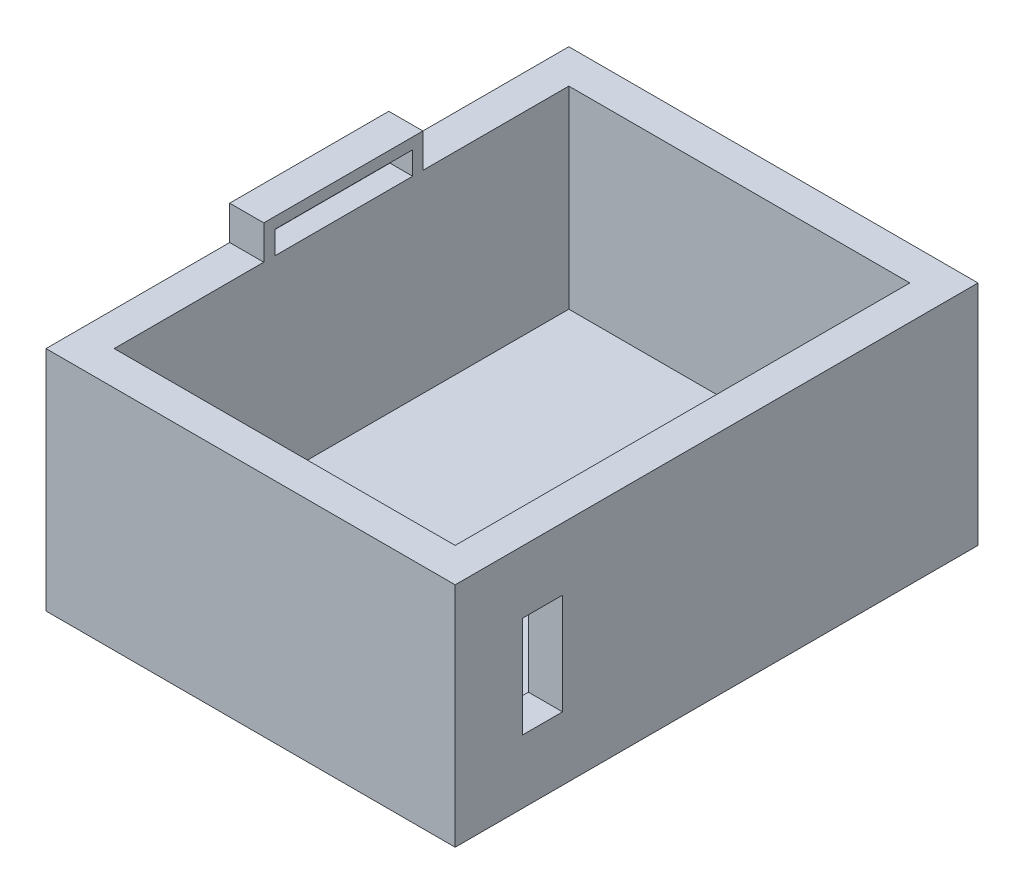
ISO-10303-21;
HEADER;
FILE_DESCRIPTION(('STEP AP214'),'2;1');
FILE_NAME('part.step','',(''),(''),'','','');
FILE_SCHEMA(('AUTOMOTIVE_DESIGN { 1 0 10303 214 1 1 1 1 }'));
ENDSEC;
DATA;
#1=APPLICATION_CONTEXT('core data for automotive mechanical design processes');
#2=APPLICATION_PROTOCOL_DEFINITION('international standard','automotive_design',2000,#1);
#3=PRODUCT_CONTEXT('',#1,'mechanical');
#4=PRODUCT('Part','Part','',(#3));
#5=PRODUCT_RELATED_PRODUCT_CATEGORY('part','',(#4));
#6=PRODUCT_DEFINITION_FORMATION('','',#4);
#7=PRODUCT_DEFINITION_CONTEXT('part definition',#1,'design');
#8=PRODUCT_DEFINITION('design','',#6,#7);
#9=PRODUCT_DEFINITION_SHAPE('','',#8);
#10=(LENGTH_UNIT() NAMED_UNIT(*) SI_UNIT(.MILLI.,.METRE.));
#11=(NAMED_UNIT(*) PLANE_ANGLE_UNIT() SI_UNIT($,.RADIAN.));
#12=(NAMED_UNIT(*) SI_UNIT($,.STERADIAN.) SOLID_ANGLE_UNIT());
#13=UNCERTAINTY_MEASURE_WITH_UNIT(LENGTH_MEASURE(1.E-05),#10,'distance_accuracy_value','');
#14=(GEOMETRIC_REPRESENTATION_CONTEXT(3) GLOBAL_UNCERTAINTY_ASSIGNED_CONTEXT((#13)) GLOBAL_UNIT_ASSIGNED_CONTEXT((#10,
#11,#12)) REPRESENTATION_CONTEXT('',''));
#15=CARTESIAN_POINT('',(0.,0.,0.));
#16=DIRECTION('',(0.,0.,1.));
#17=DIRECTION('',(1.,0.,0.));
#18=AXIS2_PLACEMENT_3D('',#15,#16,#17);
#19=CARTESIAN_POINT('',(75.,100.,-100.));
#20=DIRECTION('',(-1.,0.,0.));
#21=DIRECTION('',(0.,0.,1.));
#22=AXIS2_PLACEMENT_3D('',#19,#20,#21);
#23=PLANE('',#22);
#24=DIRECTION('',(0.,1.,0.));
#25=VECTOR('',#24,1.);
#26=CARTESIAN_POINT('',(75.,100.,85.4584047285034));
#27=LINE('',#26,#25);
#28=CARTESIAN_POINT('',(75.,27.9732756874127,85.4584047285034));
#29=VERTEX_POINT('',#28);
#30=CARTESIAN_POINT('',(75.,72.4584726693734,85.4584047285034));
#31=VERTEX_POINT('',#30);
#32=EDGE_CURVE('E205',#29,#31,#27,.T.);
#33=ORIENTED_EDGE('',*,*,#32,.F.);
#34=DIRECTION('',(0.,0.,1.));
#35=VECTOR('',#34,1.);
#36=CARTESIAN_POINT('',(75.,27.9732756874127,-100.));
#37=LINE('',#36,#35);
#38=CARTESIAN_POINT('',(75.,27.9732756874127,67.7683848760278));
#39=VERTEX_POINT('',#38);
#40=EDGE_CURVE('E198',#39,#29,#37,.T.);
#41=ORIENTED_EDGE('',*,*,#40,.F.);
#42=DIRECTION('',(0.,-1.,0.));
#43=VECTOR('',#42,1.);
#44=CARTESIAN_POINT('',(75.,100.,67.7683848760278));
#45=LINE('',#44,#43);
#46=CARTESIAN_POINT('',(75.,72.4584726693734,67.7683848760278));
#47=VERTEX_POINT('',#46);
#48=EDGE_CURVE('E179',#47,#39,#45,.T.);
#49=ORIENTED_EDGE('',*,*,#48,.F.);
#50=DIRECTION('',(0.,0.,-1.));
#51=VECTOR('',#50,1.);
#52=CARTESIAN_POINT('',(75.,72.4584726693734,-100.));
#53=LINE('',#52,#51);
#54=EDGE_CURVE('E203',#31,#47,#53,.T.);
#55=ORIENTED_EDGE('',*,*,#54,.F.);
#56=EDGE_LOOP('',(#33,#41,#49,#55));
#57=FACE_BOUND('',#56,.T.);
#58=DIRECTION('',(0.,-1.,0.));
#59=VECTOR('',#58,1.);
#60=CARTESIAN_POINT('',(75.,100.,-100.));
#61=LINE('',#60,#59);
#62=CARTESIAN_POINT('',(75.,100.,-100.));
#63=VERTEX_POINT('',#62);
#64=CARTESIAN_POINT('',(75.,15.,-100.));
#65=VERTEX_POINT('',#64);
#66=EDGE_CURVE('E294',#63,#65,#61,.T.);
#67=ORIENTED_EDGE('',*,*,#66,.T.);
#68=DIRECTION('',(0.,0.,1.));
#69=VECTOR('',#68,1.);
#70=CARTESIAN_POINT('',(75.,15.,-100.));
#71=LINE('',#70,#69);
#72=CARTESIAN_POINT('',(75.,15.,100.));
#73=VERTEX_POINT('',#72);
#74=EDGE_CURVE('E272',#65,#73,#71,.T.);
#75=ORIENTED_EDGE('',*,*,#74,.T.);
#76=DIRECTION('',(0.,-1.,0.));
#77=VECTOR('',#76,1.);
#78=CARTESIAN_POINT('',(75.,100.,100.));
#79=LINE('',#78,#77);
#80=CARTESIAN_POINT('',(75.,100.,100.));
#81=VERTEX_POINT('',#80);
#82=EDGE_CURVE('E285',#81,#73,#79,.T.);
#83=ORIENTED_EDGE('',*,*,#82,.F.);
#84=DIRECTION('',(0.,0.,-1.));
#85=VECTOR('',#84,1.);
#86=CARTESIAN_POINT('',(75.,100.,-100.));
#87=LINE('',#86,#85);
#88=EDGE_CURVE('E275',#81,#63,#87,.T.);
#89=ORIENTED_EDGE('',*,*,#88,.T.);
#90=EDGE_LOOP('',(#67,#75,#83,#89));
#91=FACE_BOUND('',#90,.T.);
#92=ADVANCED_FACE('F36',(#57,#91),#23,.T.);
#93=CARTESIAN_POINT('',(-75.,100.,-100.));
#94=DIRECTION('',(0.,0.,1.));
#95=DIRECTION('',(1.,0.,0.));
#96=AXIS2_PLACEMENT_3D('',#93,#94,#95);
#97=PLANE('',#96);
#98=DIRECTION('',(0.,-1.,0.));
#99=VECTOR('',#98,1.);
#100=CARTESIAN_POINT('',(-75.,100.,-100.));
#101=LINE('',#100,#99);
#102=CARTESIAN_POINT('',(-75.,100.,-100.));
#103=VERTEX_POINT('',#102);
#104=CARTESIAN_POINT('',(-75.,15.,-100.));
#105=VERTEX_POINT('',#104);
#106=EDGE_CURVE('E291',#103,#105,#101,.T.);
#107=ORIENTED_EDGE('',*,*,#106,.T.);
#108=DIRECTION('',(1.,0.,0.));
#109=VECTOR('',#108,1.);
#110=CARTESIAN_POINT('',(-75.,15.,-100.));
#111=LINE('',#110,#109);
#112=EDGE_CURVE('E269',#105,#65,#111,.T.);
#113=ORIENTED_EDGE('',*,*,#112,.T.);
#114=ORIENTED_EDGE('',*,*,#66,.F.);
#115=DIRECTION('',(-1.,0.,0.));
#116=VECTOR('',#115,1.);
#117=CARTESIAN_POINT('',(-75.,100.,-100.));
#118=LINE('',#117,#116);
#119=EDGE_CURVE('E277',#63,#103,#118,.T.);
#120=ORIENTED_EDGE('',*,*,#119,.T.);
#121=EDGE_LOOP('',(#107,#113,#114,#120));
#122=FACE_BOUND('',#121,.T.);
#123=ADVANCED_FACE('F361',(#122),#97,.T.);
#124=CARTESIAN_POINT('',(-75.,100.,-100.));
#125=DIRECTION('',(1.,0.,0.));
#126=DIRECTION('',(0.,0.,-1.));
#127=AXIS2_PLACEMENT_3D('',#124,#125,#126);
#128=PLANE('',#127);
#129=DIRECTION('',(0.,-1.,0.));
#130=VECTOR('',#129,1.);
#131=CARTESIAN_POINT('',(-75.,110.102082312034,29.2233790622416));
#132=LINE('',#131,#130);
#133=CARTESIAN_POINT('',(-75.,110.102082312034,29.2233790622416));
#134=VERTEX_POINT('',#133);
#135=CARTESIAN_POINT('',(-75.,100.,29.2233790622416));
#136=VERTEX_POINT('',#135);
#137=EDGE_CURVE('E207',#134,#136,#132,.T.);
#138=ORIENTED_EDGE('',*,*,#137,.F.);
#139=DIRECTION('',(0.,0.,1.));
#140=VECTOR('',#139,1.);
#141=CARTESIAN_POINT('',(-75.,110.102082312034,29.2233790622416));
#142=LINE('',#141,#140);
#143=CARTESIAN_POINT('',(-75.,110.102082312034,-31.3014860177789));
#144=VERTEX_POINT('',#143);
#145=EDGE_CURVE('E212',#144,#134,#142,.T.);
#146=ORIENTED_EDGE('',*,*,#145,.F.);
#147=DIRECTION('',(0.,1.,0.));
#148=VECTOR('',#147,1.);
#149=CARTESIAN_POINT('',(-75.,110.102082312034,-31.3014860177789));
#150=LINE('',#149,#148);
#151=CARTESIAN_POINT('',(-75.,100.,-31.3014860177789));
#152=VERTEX_POINT('',#151);
#153=EDGE_CURVE('E226',#152,#144,#150,.T.);
#154=ORIENTED_EDGE('',*,*,#153,.F.);
#155=DIRECTION('',(0.,0.,-1.));
#156=VECTOR('',#155,1.);
#157=CARTESIAN_POINT('',(-75.,100.,29.2233790622416));
#158=LINE('',#157,#156);
#159=EDGE_CURVE('E223',#136,#152,#158,.T.);
#160=ORIENTED_EDGE('',*,*,#159,.F.);
#161=EDGE_LOOP('',(#138,#146,#154,#160));
#162=FACE_BOUND('',#161,.T.);
#163=DIRECTION('',(0.,-1.,0.));
#164=VECTOR('',#163,1.);
#165=CARTESIAN_POINT('',(-75.,100.,100.));
#166=LINE('',#165,#164);
#167=CARTESIAN_POINT('',(-75.,100.,100.));
#168=VERTEX_POINT('',#167);
#169=CARTESIAN_POINT('',(-75.,15.,100.));
#170=VERTEX_POINT('',#169);
#171=EDGE_CURVE('E288',#168,#170,#166,.T.);
#172=ORIENTED_EDGE('',*,*,#171,.T.);
#173=DIRECTION('',(0.,0.,-1.));
#174=VECTOR('',#173,1.);
#175=CARTESIAN_POINT('',(-75.,15.,-100.));
#176=LINE('',#175,#174);
#177=EDGE_CURVE('E266',#170,#105,#176,.T.);
#178=ORIENTED_EDGE('',*,*,#177,.T.);
#179=ORIENTED_EDGE('',*,*,#106,.F.);
#180=DIRECTION('',(0.,0.,1.));
#181=VECTOR('',#180,1.);
#182=CARTESIAN_POINT('',(-75.,100.,-100.));
#183=LINE('',#182,#181);
#184=CARTESIAN_POINT('',(-75.,100.,-35.8015043884086));
#185=VERTEX_POINT('',#184);
#186=EDGE_CURVE('E280',#103,#185,#183,.T.);
#187=ORIENTED_EDGE('',*,*,#186,.T.);
#188=DIRECTION('',(0.,-1.,0.));
#189=VECTOR('',#188,1.);
#190=CARTESIAN_POINT('',(-75.,115.,-35.8015043884086));
#191=LINE('',#190,#189);
#192=CARTESIAN_POINT('',(-75.,115.,-35.8015043884086));
#193=VERTEX_POINT('',#192);
#194=EDGE_CURVE('E263',#193,#185,#191,.T.);
#195=ORIENTED_EDGE('',*,*,#194,.F.);
#196=DIRECTION('',(0.,0.,-1.));
#197=VECTOR('',#196,1.);
#198=CARTESIAN_POINT('',(-75.,115.,-35.8015043884086));
#199=LINE('',#198,#197);
#200=CARTESIAN_POINT('',(-75.,115.,34.1984956115914));
#201=VERTEX_POINT('',#200);
#202=EDGE_CURVE('E240',#201,#193,#199,.T.);
#203=ORIENTED_EDGE('',*,*,#202,.F.);
#204=DIRECTION('',(0.,-1.,0.));
#205=VECTOR('',#204,1.);
#206=CARTESIAN_POINT('',(-75.,115.,34.1984956115914));
#207=LINE('',#206,#205);
#208=CARTESIAN_POINT('',(-75.,100.,34.1984956115914));
#209=VERTEX_POINT('',#208);
#210=EDGE_CURVE('E250',#201,#209,#207,.T.);
#211=ORIENTED_EDGE('',*,*,#210,.T.);
#212=EDGE_CURVE('E279',#209,#168,#183,.T.);
#213=ORIENTED_EDGE('',*,*,#212,.T.);
#214=EDGE_LOOP('',(#172,#178,#179,#187,#195,#203,#211,#213));
#215=FACE_BOUND('',#214,.T.);
#216=ADVANCED_FACE('F354',(#162,#215),#128,.T.);
#217=CARTESIAN_POINT('',(-75.,100.,100.));
#218=DIRECTION('',(0.,0.,-1.));
#219=DIRECTION('',(-1.,0.,0.));
#220=AXIS2_PLACEMENT_3D('',#217,#218,#219);
#221=PLANE('',#220);
#222=ORIENTED_EDGE('',*,*,#82,.T.);
#223=DIRECTION('',(-1.,0.,0.));
#224=VECTOR('',#223,1.);
#225=CARTESIAN_POINT('',(-75.,15.,100.));
#226=LINE('',#225,#224);
#227=EDGE_CURVE('E11',#73,#170,#226,.T.);
#228=ORIENTED_EDGE('',*,*,#227,.T.);
#229=ORIENTED_EDGE('',*,*,#171,.F.);
#230=DIRECTION('',(1.,0.,0.));
#231=VECTOR('',#230,1.);
#232=CARTESIAN_POINT('',(-75.,100.,100.));
#233=LINE('',#232,#231);
#234=EDGE_CURVE('E283',#168,#81,#233,.T.);
#235=ORIENTED_EDGE('',*,*,#234,.T.);
#236=EDGE_LOOP('',(#222,#228,#229,#235));
#237=FACE_BOUND('',#236,.T.);
#238=ADVANCED_FACE('F365',(#237),#221,.T.);
#239=CARTESIAN_POINT('',(0.,100.,0.));
#240=DIRECTION('',(0.,1.,0.));
#241=DIRECTION('',(0.,0.,1.));
#242=AXIS2_PLACEMENT_3D('',#239,#240,#241);
#243=PLANE('',#242);
#244=DIRECTION('',(1.,0.,0.));
#245=VECTOR('',#244,1.);
#246=CARTESIAN_POINT('',(-90.,100.,34.1984956115914));
#247=LINE('',#246,#245);
#248=CARTESIAN_POINT('',(-90.,100.,34.1984956115914));
#249=VERTEX_POINT('',#248);
#250=EDGE_CURVE('E244',#249,#209,#247,.T.);
#251=ORIENTED_EDGE('',*,*,#250,.F.);
#252=DIRECTION('',(0.,0.,1.));
#253=VECTOR('',#252,1.);
#254=CARTESIAN_POINT('',(-90.,100.,-115.));
#255=LINE('',#254,#253);
#256=CARTESIAN_POINT('',(-89.9999999999999,100.,115.));
#257=VERTEX_POINT('',#256);
#258=EDGE_CURVE('E304',#249,#257,#255,.T.);
#259=ORIENTED_EDGE('',*,*,#258,.T.);
#260=DIRECTION('',(1.,0.,0.));
#261=VECTOR('',#260,1.);
#262=CARTESIAN_POINT('',(-89.9999999999999,100.,115.));
#263=LINE('',#262,#261);
#264=CARTESIAN_POINT('',(90.,100.,115.));
#265=VERTEX_POINT('',#264);
#266=EDGE_CURVE('E307',#257,#265,#263,.T.);
#267=ORIENTED_EDGE('',*,*,#266,.T.);
#268=DIRECTION('',(0.,0.,-1.));
#269=VECTOR('',#268,1.);
#270=CARTESIAN_POINT('',(89.9999999999999,100.,-115.));
#271=LINE('',#270,#269);
#272=CARTESIAN_POINT('',(89.9999999999999,100.,-115.));
#273=VERTEX_POINT('',#272);
#274=EDGE_CURVE('E298',#265,#273,#271,.T.);
#275=ORIENTED_EDGE('',*,*,#274,.T.);
#276=DIRECTION('',(-1.,0.,0.));
#277=VECTOR('',#276,1.);
#278=CARTESIAN_POINT('',(-90.,100.,-115.));
#279=LINE('',#278,#277);
#280=CARTESIAN_POINT('',(-90.,100.,-115.));
#281=VERTEX_POINT('',#280);
#282=EDGE_CURVE('E301',#273,#281,#279,.T.);
#283=ORIENTED_EDGE('',*,*,#282,.T.);
#284=CARTESIAN_POINT('',(-90.,100.,-35.8015043884086));
#285=VERTEX_POINT('',#284);
#286=EDGE_CURVE('E305',#281,#285,#255,.T.);
#287=ORIENTED_EDGE('',*,*,#286,.T.);
#288=DIRECTION('',(-1.,0.,0.));
#289=VECTOR('',#288,1.);
#290=CARTESIAN_POINT('',(-90.,100.,-35.8015043884086));
#291=LINE('',#290,#289);
#292=EDGE_CURVE('E233',#185,#285,#291,.T.);
#293=ORIENTED_EDGE('',*,*,#292,.F.);
#294=ORIENTED_EDGE('',*,*,#186,.F.);
#295=ORIENTED_EDGE('',*,*,#119,.F.);
#296=ORIENTED_EDGE('',*,*,#88,.F.);
#297=ORIENTED_EDGE('',*,*,#234,.F.);
#298=ORIENTED_EDGE('',*,*,#212,.F.);
#299=EDGE_LOOP('',(#251,#259,#267,#275,#283,#287,#293,#294,#295,#296,#297,#298));
#300=FACE_BOUND('',#299,.T.);
#301=ADVANCED_FACE('F347',(#300),#243,.T.);
#302=CARTESIAN_POINT('',(0.,0.,0.));
#303=DIRECTION('',(0.,1.,0.));
#304=DIRECTION('',(0.,0.,1.));
#305=AXIS2_PLACEMENT_3D('',#302,#303,#304);
#306=PLANE('',#305);
#307=DIRECTION('',(0.,0.,-1.));
#308=VECTOR('',#307,1.);
#309=CARTESIAN_POINT('',(89.9999999999999,0.,-115.));
#310=LINE('',#309,#308);
#311=CARTESIAN_POINT('',(90.,0.,115.));
#312=VERTEX_POINT('',#311);
#313=CARTESIAN_POINT('',(89.9999999999999,0.,-115.));
#314=VERTEX_POINT('',#313);
#315=EDGE_CURVE('E297',#312,#314,#310,.T.);
#316=ORIENTED_EDGE('',*,*,#315,.F.);
#317=DIRECTION('',(1.,0.,0.));
#318=VECTOR('',#317,1.);
#319=CARTESIAN_POINT('',(-89.9999999999999,0.,115.));
#320=LINE('',#319,#318);
#321=CARTESIAN_POINT('',(-89.9999999999999,0.,115.));
#322=VERTEX_POINT('',#321);
#323=EDGE_CURVE('E302',#322,#312,#320,.T.);
#324=ORIENTED_EDGE('',*,*,#323,.F.);
#325=DIRECTION('',(0.,0.,1.));
#326=VECTOR('',#325,1.);
#327=CARTESIAN_POINT('',(-90.,0.,-115.));
#328=LINE('',#327,#326);
#329=CARTESIAN_POINT('',(-90.,0.,-115.));
#330=VERTEX_POINT('',#329);
#331=EDGE_CURVE('E315',#330,#322,#328,.T.);
#332=ORIENTED_EDGE('',*,*,#331,.F.);
#333=DIRECTION('',(-1.,0.,0.));
#334=VECTOR('',#333,1.);
#335=CARTESIAN_POINT('',(-90.,0.,-115.));
#336=LINE('',#335,#334);
#337=EDGE_CURVE('E312',#314,#330,#336,.T.);
#338=ORIENTED_EDGE('',*,*,#337,.F.);
#339=EDGE_LOOP('',(#316,#324,#332,#338));
#340=FACE_BOUND('',#339,.T.);
#341=ADVANCED_FACE('F333',(#340),#306,.F.);
#342=CARTESIAN_POINT('',(89.9999999999999,100.,-115.));
#343=DIRECTION('',(-1.,0.,0.));
#344=DIRECTION('',(0.,0.,1.));
#345=AXIS2_PLACEMENT_3D('',#342,#343,#344);
#346=PLANE('',#345);
#347=DIRECTION('',(0.,0.,-1.));
#348=VECTOR('',#347,1.);
#349=CARTESIAN_POINT('',(90.,27.9732756874127,85.4584047285034));
#350=LINE('',#349,#348);
#351=CARTESIAN_POINT('',(90.,27.9732756874127,85.4584047285034));
#352=VERTEX_POINT('',#351);
#353=CARTESIAN_POINT('',(90.,27.9732756874127,67.7683848760278));
#354=VERTEX_POINT('',#353);
#355=EDGE_CURVE('E185',#352,#354,#350,.T.);
#356=ORIENTED_EDGE('',*,*,#355,.F.);
#357=DIRECTION('',(0.,-1.,0.));
#358=VECTOR('',#357,1.);
#359=CARTESIAN_POINT('',(90.,72.4584726693734,85.4584047285034));
#360=LINE('',#359,#358);
#361=CARTESIAN_POINT('',(90.,72.4584726693734,85.4584047285034));
#362=VERTEX_POINT('',#361);
#363=EDGE_CURVE('E59',#362,#352,#360,.T.);
#364=ORIENTED_EDGE('',*,*,#363,.F.);
#365=DIRECTION('',(0.,0.,1.));
#366=VECTOR('',#365,1.);
#367=CARTESIAN_POINT('',(90.,72.4584726693734,85.4584047285034));
#368=LINE('',#367,#366);
#369=CARTESIAN_POINT('',(90.,72.4584726693734,67.7683848760278));
#370=VERTEX_POINT('',#369);
#371=EDGE_CURVE('E191',#370,#362,#368,.T.);
#372=ORIENTED_EDGE('',*,*,#371,.F.);
#373=DIRECTION('',(0.,1.,0.));
#374=VECTOR('',#373,1.);
#375=CARTESIAN_POINT('',(90.,72.4584726693734,67.7683848760278));
#376=LINE('',#375,#374);
#377=EDGE_CURVE('E176',#354,#370,#376,.T.);
#378=ORIENTED_EDGE('',*,*,#377,.F.);
#379=EDGE_LOOP('',(#356,#364,#372,#378));
#380=FACE_BOUND('',#379,.T.);
#381=ORIENTED_EDGE('',*,*,#315,.T.);
#382=DIRECTION('',(0.,-1.,0.));
#383=VECTOR('',#382,1.);
#384=CARTESIAN_POINT('',(89.9999999999999,100.,-115.));
#385=LINE('',#384,#383);
#386=EDGE_CURVE('E44',#273,#314,#385,.T.);
#387=ORIENTED_EDGE('',*,*,#386,.F.);
#388=ORIENTED_EDGE('',*,*,#274,.F.);
#389=DIRECTION('',(0.,-1.,0.));
#390=VECTOR('',#389,1.);
#391=CARTESIAN_POINT('',(90.,100.,115.));
#392=LINE('',#391,#390);
#393=EDGE_CURVE('E309',#265,#312,#392,.T.);
#394=ORIENTED_EDGE('',*,*,#393,.T.);
#395=EDGE_LOOP('',(#381,#387,#388,#394));
#396=FACE_BOUND('',#395,.T.);
#397=ADVANCED_FACE('F38',(#380,#396),#346,.F.);
#398=CARTESIAN_POINT('',(-90.,100.,-115.));
#399=DIRECTION('',(0.,0.,1.));
#400=DIRECTION('',(1.,0.,0.));
#401=AXIS2_PLACEMENT_3D('',#398,#399,#400);
#402=PLANE('',#401);
#403=ORIENTED_EDGE('',*,*,#337,.T.);
#404=DIRECTION('',(0.,-1.,0.));
#405=VECTOR('',#404,1.);
#406=CARTESIAN_POINT('',(-90.,100.,-115.));
#407=LINE('',#406,#405);
#408=EDGE_CURVE('E323',#281,#330,#407,.T.);
#409=ORIENTED_EDGE('',*,*,#408,.F.);
#410=ORIENTED_EDGE('',*,*,#282,.F.);
#411=ORIENTED_EDGE('',*,*,#386,.T.);
#412=EDGE_LOOP('',(#403,#409,#410,#411));
#413=FACE_BOUND('',#412,.T.);
#414=ADVANCED_FACE('F327',(#413),#402,.F.);
#415=CARTESIAN_POINT('',(-90.,100.,-115.));
#416=DIRECTION('',(1.,0.,0.));
#417=DIRECTION('',(0.,0.,-1.));
#418=AXIS2_PLACEMENT_3D('',#415,#416,#417);
#419=PLANE('',#418);
#420=ORIENTED_EDGE('',*,*,#331,.T.);
#421=DIRECTION('',(0.,-1.,0.));
#422=VECTOR('',#421,1.);
#423=CARTESIAN_POINT('',(-89.9999999999999,100.,115.));
#424=LINE('',#423,#422);
#425=EDGE_CURVE('E321',#257,#322,#424,.T.);
#426=ORIENTED_EDGE('',*,*,#425,.F.);
#427=ORIENTED_EDGE('',*,*,#258,.F.);
#428=DIRECTION('',(0.,-1.,0.));
#429=VECTOR('',#428,1.);
#430=CARTESIAN_POINT('',(-90.,115.,34.1984956115914));
#431=LINE('',#430,#429);
#432=CARTESIAN_POINT('',(-90.,115.,34.1984956115914));
#433=VERTEX_POINT('',#432);
#434=EDGE_CURVE('E257',#433,#249,#431,.T.);
#435=ORIENTED_EDGE('',*,*,#434,.F.);
#436=DIRECTION('',(0.,0.,1.));
#437=VECTOR('',#436,1.);
#438=CARTESIAN_POINT('',(-90.,115.,-35.8015043884086));
#439=LINE('',#438,#437);
#440=CARTESIAN_POINT('',(-90.,115.,-35.8015043884086));
#441=VERTEX_POINT('',#440);
#442=EDGE_CURVE('E246',#441,#433,#439,.T.);
#443=ORIENTED_EDGE('',*,*,#442,.F.);
#444=DIRECTION('',(0.,-1.,0.));
#445=VECTOR('',#444,1.);
#446=CARTESIAN_POINT('',(-90.,115.,-35.8015043884086));
#447=LINE('',#446,#445);
#448=EDGE_CURVE('E260',#441,#285,#447,.T.);
#449=ORIENTED_EDGE('',*,*,#448,.T.);
#450=ORIENTED_EDGE('',*,*,#286,.F.);
#451=ORIENTED_EDGE('',*,*,#408,.T.);
#452=EDGE_LOOP('',(#420,#426,#427,#435,#443,#449,#450,#451));
#453=FACE_BOUND('',#452,.T.);
#454=ADVANCED_FACE('F342',(#453),#419,.F.);
#455=CARTESIAN_POINT('',(-89.9999999999999,100.,115.));
#456=DIRECTION('',(0.,0.,-1.));
#457=DIRECTION('',(-1.,0.,0.));
#458=AXIS2_PLACEMENT_3D('',#455,#456,#457);
#459=PLANE('',#458);
#460=ORIENTED_EDGE('',*,*,#323,.T.);
#461=ORIENTED_EDGE('',*,*,#393,.F.);
#462=ORIENTED_EDGE('',*,*,#266,.F.);
#463=ORIENTED_EDGE('',*,*,#425,.T.);
#464=EDGE_LOOP('',(#460,#461,#462,#463));
#465=FACE_BOUND('',#464,.T.);
#466=ADVANCED_FACE('F338',(#465),#459,.F.);
#467=CARTESIAN_POINT('',(0.,15.,0.));
#468=DIRECTION('',(0.,-1.,0.));
#469=DIRECTION('',(0.,0.,-1.));
#470=AXIS2_PLACEMENT_3D('',#467,#468,#469);
#471=PLANE('',#470);
#472=ORIENTED_EDGE('',*,*,#74,.F.);
#473=ORIENTED_EDGE('',*,*,#112,.F.);
#474=ORIENTED_EDGE('',*,*,#177,.F.);
#475=ORIENTED_EDGE('',*,*,#227,.F.);
#476=EDGE_LOOP('',(#472,#473,#474,#475));
#477=FACE_BOUND('',#476,.T.);
#478=ADVANCED_FACE('F402',(#477),#471,.F.);
#479=CARTESIAN_POINT('',(-90.,115.,-35.8015043884086));
#480=DIRECTION('',(0.,0.,1.));
#481=DIRECTION('',(1.,0.,0.));
#482=AXIS2_PLACEMENT_3D('',#479,#480,#481);
#483=PLANE('',#482);
#484=ORIENTED_EDGE('',*,*,#292,.T.);
#485=ORIENTED_EDGE('',*,*,#448,.F.);
#486=DIRECTION('',(-1.,0.,0.));
#487=VECTOR('',#486,1.);
#488=CARTESIAN_POINT('',(-90.,115.,-35.8015043884086));
#489=LINE('',#488,#487);
#490=EDGE_CURVE('E243',#193,#441,#489,.T.);
#491=ORIENTED_EDGE('',*,*,#490,.F.);
#492=ORIENTED_EDGE('',*,*,#194,.T.);
#493=EDGE_LOOP('',(#484,#485,#491,#492));
#494=FACE_BOUND('',#493,.T.);
#495=ADVANCED_FACE('F350',(#494),#483,.F.);
#496=CARTESIAN_POINT('',(-90.,115.,34.1984956115914));
#497=DIRECTION('',(0.,0.,-1.));
#498=DIRECTION('',(-1.,0.,0.));
#499=AXIS2_PLACEMENT_3D('',#496,#497,#498);
#500=PLANE('',#499);
#501=ORIENTED_EDGE('',*,*,#250,.T.);
#502=ORIENTED_EDGE('',*,*,#210,.F.);
#503=DIRECTION('',(1.,0.,0.));
#504=VECTOR('',#503,1.);
#505=CARTESIAN_POINT('',(-90.,115.,34.1984956115914));
#506=LINE('',#505,#504);
#507=EDGE_CURVE('E248',#433,#201,#506,.T.);
#508=ORIENTED_EDGE('',*,*,#507,.F.);
#509=ORIENTED_EDGE('',*,*,#434,.T.);
#510=EDGE_LOOP('',(#501,#502,#508,#509));
#511=FACE_BOUND('',#510,.T.);
#512=ADVANCED_FACE('F369',(#511),#500,.F.);
#513=CARTESIAN_POINT('',(0.,115.,0.));
#514=DIRECTION('',(0.,1.,0.));
#515=DIRECTION('',(0.,0.,1.));
#516=AXIS2_PLACEMENT_3D('',#513,#514,#515);
#517=PLANE('',#516);
#518=ORIENTED_EDGE('',*,*,#202,.T.);
#519=ORIENTED_EDGE('',*,*,#490,.T.);
#520=ORIENTED_EDGE('',*,*,#442,.T.);
#521=ORIENTED_EDGE('',*,*,#507,.T.);
#522=EDGE_LOOP('',(#518,#519,#520,#521));
#523=FACE_BOUND('',#522,.T.);
#524=ADVANCED_FACE('F373',(#523),#517,.T.);
#525=CARTESIAN_POINT('',(-85.,110.102082312034,29.2233790622416));
#526=DIRECTION('',(0.,0.,1.));
#527=DIRECTION('',(1.,0.,0.));
#528=AXIS2_PLACEMENT_3D('',#525,#526,#527);
#529=PLANE('',#528);
#530=ORIENTED_EDGE('',*,*,#137,.T.);
#531=DIRECTION('',(1.,0.,0.));
#532=VECTOR('',#531,1.);
#533=CARTESIAN_POINT('',(-85.,100.,29.2233790622416));
#534=LINE('',#533,#532);
#535=CARTESIAN_POINT('',(-85.,100.,29.2233790622416));
#536=VERTEX_POINT('',#535);
#537=EDGE_CURVE('E221',#536,#136,#534,.T.);
#538=ORIENTED_EDGE('',*,*,#537,.F.);
#539=DIRECTION('',(0.,-1.,0.));
#540=VECTOR('',#539,1.);
#541=CARTESIAN_POINT('',(-85.,110.102082312034,29.2233790622416));
#542=LINE('',#541,#540);
#543=CARTESIAN_POINT('',(-85.,110.102082312034,29.2233790622416));
#544=VERTEX_POINT('',#543);
#545=EDGE_CURVE('E208',#544,#536,#542,.T.);
#546=ORIENTED_EDGE('',*,*,#545,.F.);
#547=DIRECTION('',(1.,0.,0.));
#548=VECTOR('',#547,1.);
#549=CARTESIAN_POINT('',(-85.,110.102082312034,29.2233790622416));
#550=LINE('',#549,#548);
#551=EDGE_CURVE('E231',#544,#134,#550,.T.);
#552=ORIENTED_EDGE('',*,*,#551,.T.);
#553=EDGE_LOOP('',(#530,#538,#546,#552));
#554=FACE_BOUND('',#553,.T.);
#555=ADVANCED_FACE('F375',(#554),#529,.F.);
#556=CARTESIAN_POINT('',(-85.,110.102082312034,29.2233790622416));
#557=DIRECTION('',(0.,1.,0.));
#558=DIRECTION('',(0.,0.,1.));
#559=AXIS2_PLACEMENT_3D('',#556,#557,#558);
#560=PLANE('',#559);
#561=ORIENTED_EDGE('',*,*,#145,.T.);
#562=ORIENTED_EDGE('',*,*,#551,.F.);
#563=DIRECTION('',(0.,0.,1.));
#564=VECTOR('',#563,1.);
#565=CARTESIAN_POINT('',(-85.,110.102082312034,29.2233790622416));
#566=LINE('',#565,#564);
#567=CARTESIAN_POINT('',(-85.,110.102082312034,-31.3014860177789));
#568=VERTEX_POINT('',#567);
#569=EDGE_CURVE('E218',#568,#544,#566,.T.);
#570=ORIENTED_EDGE('',*,*,#569,.F.);
#571=DIRECTION('',(1.,0.,0.));
#572=VECTOR('',#571,1.);
#573=CARTESIAN_POINT('',(-85.,110.102082312034,-31.3014860177789));
#574=LINE('',#573,#572);
#575=EDGE_CURVE('E234',#568,#144,#574,.T.);
#576=ORIENTED_EDGE('',*,*,#575,.T.);
#577=EDGE_LOOP('',(#561,#562,#570,#576));
#578=FACE_BOUND('',#577,.T.);
#579=ADVANCED_FACE('F381',(#578),#560,.F.);
#580=CARTESIAN_POINT('',(-85.,110.102082312034,-31.3014860177789));
#581=DIRECTION('',(0.,0.,-1.));
#582=DIRECTION('',(-1.,0.,0.));
#583=AXIS2_PLACEMENT_3D('',#580,#581,#582);
#584=PLANE('',#583);
#585=ORIENTED_EDGE('',*,*,#153,.T.);
#586=ORIENTED_EDGE('',*,*,#575,.F.);
#587=DIRECTION('',(0.,1.,0.));
#588=VECTOR('',#587,1.);
#589=CARTESIAN_POINT('',(-85.,110.102082312034,-31.3014860177789));
#590=LINE('',#589,#588);
#591=CARTESIAN_POINT('',(-85.,100.,-31.3014860177789));
#592=VERTEX_POINT('',#591);
#593=EDGE_CURVE('E215',#592,#568,#590,.T.);
#594=ORIENTED_EDGE('',*,*,#593,.F.);
#595=DIRECTION('',(1.,0.,0.));
#596=VECTOR('',#595,1.);
#597=CARTESIAN_POINT('',(-85.,100.,-31.3014860177789));
#598=LINE('',#597,#596);
#599=EDGE_CURVE('E236',#592,#152,#598,.T.);
#600=ORIENTED_EDGE('',*,*,#599,.T.);
#601=EDGE_LOOP('',(#585,#586,#594,#600));
#602=FACE_BOUND('',#601,.T.);
#603=ADVANCED_FACE('F471',(#602),#584,.F.);
#604=CARTESIAN_POINT('',(-85.,100.,29.2233790622416));
#605=DIRECTION('',(0.,-1.,0.));
#606=DIRECTION('',(0.,0.,-1.));
#607=AXIS2_PLACEMENT_3D('',#604,#605,#606);
#608=PLANE('',#607);
#609=ORIENTED_EDGE('',*,*,#159,.T.);
#610=ORIENTED_EDGE('',*,*,#599,.F.);
#611=DIRECTION('',(0.,0.,-1.));
#612=VECTOR('',#611,1.);
#613=CARTESIAN_POINT('',(-85.,100.,29.2233790622416));
#614=LINE('',#613,#612);
#615=EDGE_CURVE('E211',#536,#592,#614,.T.);
#616=ORIENTED_EDGE('',*,*,#615,.F.);
#617=ORIENTED_EDGE('',*,*,#537,.T.);
#618=EDGE_LOOP('',(#609,#610,#616,#617));
#619=FACE_BOUND('',#618,.T.);
#620=ADVANCED_FACE('F459',(#619),#608,.F.);
#621=CARTESIAN_POINT('',(-85.,0.,0.));
#622=DIRECTION('',(1.,0.,0.));
#623=DIRECTION('',(0.,0.,-1.));
#624=AXIS2_PLACEMENT_3D('',#621,#622,#623);
#625=PLANE('',#624);
#626=ORIENTED_EDGE('',*,*,#545,.T.);
#627=ORIENTED_EDGE('',*,*,#615,.T.);
#628=ORIENTED_EDGE('',*,*,#593,.T.);
#629=ORIENTED_EDGE('',*,*,#569,.T.);
#630=EDGE_LOOP('',(#626,#627,#628,#629));
#631=FACE_BOUND('',#630,.T.);
#632=ADVANCED_FACE('F453',(#631),#625,.T.);
#633=CARTESIAN_POINT('',(70.,72.4584726693734,85.4584047285034));
#634=DIRECTION('',(0.,0.,1.));
#635=DIRECTION('',(1.,0.,0.));
#636=AXIS2_PLACEMENT_3D('',#633,#634,#635);
#637=PLANE('',#636);
#638=ORIENTED_EDGE('',*,*,#32,.T.);
#639=DIRECTION('',(1.,0.,0.));
#640=VECTOR('',#639,1.);
#641=CARTESIAN_POINT('',(70.,72.4584726693734,85.4584047285034));
#642=LINE('',#641,#640);
#643=EDGE_CURVE('E196',#31,#362,#642,.T.);
#644=ORIENTED_EDGE('',*,*,#643,.T.);
#645=ORIENTED_EDGE('',*,*,#363,.T.);
#646=DIRECTION('',(1.,0.,0.));
#647=VECTOR('',#646,1.);
#648=CARTESIAN_POINT('',(70.,27.9732756874127,85.4584047285034));
#649=LINE('',#648,#647);
#650=EDGE_CURVE('E182',#29,#352,#649,.T.);
#651=ORIENTED_EDGE('',*,*,#650,.F.);
#652=EDGE_LOOP('',(#638,#644,#645,#651));
#653=FACE_BOUND('',#652,.T.);
#654=ADVANCED_FACE('F458',(#653),#637,.F.);
#655=CARTESIAN_POINT('',(70.,72.4584726693734,85.4584047285034));
#656=DIRECTION('',(0.,1.,0.));
#657=DIRECTION('',(0.,0.,1.));
#658=AXIS2_PLACEMENT_3D('',#655,#656,#657);
#659=PLANE('',#658);
#660=ORIENTED_EDGE('',*,*,#54,.T.);
#661=DIRECTION('',(1.,0.,0.));
#662=VECTOR('',#661,1.);
#663=CARTESIAN_POINT('',(70.,72.4584726693734,67.7683848760278));
#664=LINE('',#663,#662);
#665=EDGE_CURVE('E181',#47,#370,#664,.T.);
#666=ORIENTED_EDGE('',*,*,#665,.T.);
#667=ORIENTED_EDGE('',*,*,#371,.T.);
#668=ORIENTED_EDGE('',*,*,#643,.F.);
#669=EDGE_LOOP('',(#660,#666,#667,#668));
#670=FACE_BOUND('',#669,.T.);
#671=ADVANCED_FACE('F564',(#670),#659,.F.);
#672=CARTESIAN_POINT('',(70.,72.4584726693734,67.7683848760278));
#673=DIRECTION('',(0.,0.,-1.));
#674=DIRECTION('',(-1.,0.,0.));
#675=AXIS2_PLACEMENT_3D('',#672,#673,#674);
#676=PLANE('',#675);
#677=ORIENTED_EDGE('',*,*,#48,.T.);
#678=DIRECTION('',(1.,0.,0.));
#679=VECTOR('',#678,1.);
#680=CARTESIAN_POINT('',(70.,27.9732756874127,67.7683848760278));
#681=LINE('',#680,#679);
#682=EDGE_CURVE('E51',#39,#354,#681,.T.);
#683=ORIENTED_EDGE('',*,*,#682,.T.);
#684=ORIENTED_EDGE('',*,*,#377,.T.);
#685=ORIENTED_EDGE('',*,*,#665,.F.);
#686=EDGE_LOOP('',(#677,#683,#684,#685));
#687=FACE_BOUND('',#686,.T.);
#688=ADVANCED_FACE('F173',(#687),#676,.F.);
#689=CARTESIAN_POINT('',(70.,27.9732756874127,85.4584047285034));
#690=DIRECTION('',(0.,-1.,0.));
#691=DIRECTION('',(0.,0.,-1.));
#692=AXIS2_PLACEMENT_3D('',#689,#690,#691);
#693=PLANE('',#692);
#694=ORIENTED_EDGE('',*,*,#40,.T.);
#695=ORIENTED_EDGE('',*,*,#650,.T.);
#696=ORIENTED_EDGE('',*,*,#355,.T.);
#697=ORIENTED_EDGE('',*,*,#682,.F.);
#698=EDGE_LOOP('',(#694,#695,#696,#697));
#699=FACE_BOUND('',#698,.T.);
#700=ADVANCED_FACE('F186',(#699),#693,.F.);
#701=CLOSED_SHELL('',(#92,#123,#216,#238,#301,#341,#397,#414,#454,#466,#478,#495,#512,#524,#555,
#579,#603,#620,#632,#654,#671,#688,#700));
#702=MANIFOLD_SOLID_BREP('B2',#701);
#703=ADVANCED_BREP_SHAPE_REPRESENTATION('',(#18,#702),#14);
#704=SHAPE_DEFINITION_REPRESENTATION(#9,#703);
ENDSEC;
END-ISO-10303-21;
